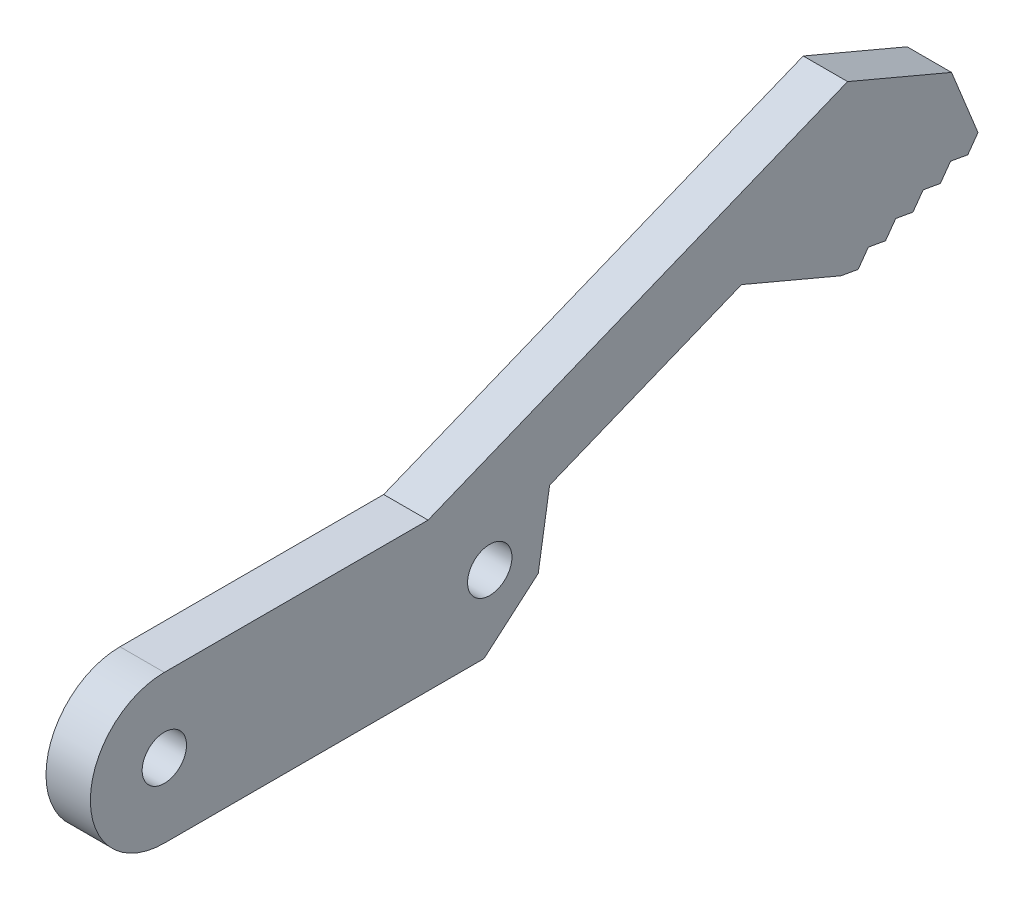
ISO-10303-21;
HEADER;
FILE_DESCRIPTION(('STEP AP214'),'2;1');
FILE_NAME('part.step','',(''),(''),'','','');
FILE_SCHEMA(('AUTOMOTIVE_DESIGN { 1 0 10303 214 1 1 1 1 }'));
ENDSEC;
DATA;
#1=APPLICATION_CONTEXT('core data for automotive mechanical design processes');
#2=APPLICATION_PROTOCOL_DEFINITION('international standard','automotive_design',2000,#1);
#3=PRODUCT_CONTEXT('',#1,'mechanical');
#4=PRODUCT('Part','Part','',(#3));
#5=PRODUCT_RELATED_PRODUCT_CATEGORY('part','',(#4));
#6=PRODUCT_DEFINITION_FORMATION('','',#4);
#7=PRODUCT_DEFINITION_CONTEXT('part definition',#1,'design');
#8=PRODUCT_DEFINITION('design','',#6,#7);
#9=PRODUCT_DEFINITION_SHAPE('','',#8);
#10=(LENGTH_UNIT() NAMED_UNIT(*) SI_UNIT(.MILLI.,.METRE.));
#11=(NAMED_UNIT(*) PLANE_ANGLE_UNIT() SI_UNIT($,.RADIAN.));
#12=(NAMED_UNIT(*) SI_UNIT($,.STERADIAN.) SOLID_ANGLE_UNIT());
#13=UNCERTAINTY_MEASURE_WITH_UNIT(LENGTH_MEASURE(1.E-05),#10,'distance_accuracy_value','');
#14=(GEOMETRIC_REPRESENTATION_CONTEXT(3) GLOBAL_UNCERTAINTY_ASSIGNED_CONTEXT((#13)) GLOBAL_UNIT_ASSIGNED_CONTEXT((#10,
#11,#12)) REPRESENTATION_CONTEXT('',''));
#15=CARTESIAN_POINT('',(0.,0.,0.));
#16=DIRECTION('',(0.,0.,1.));
#17=DIRECTION('',(1.,0.,0.));
#18=AXIS2_PLACEMENT_3D('',#15,#16,#17);
#19=CARTESIAN_POINT('',(1.5,0.,0.));
#20=DIRECTION('',(1.,0.,0.));
#21=DIRECTION('',(0.,0.,-1.));
#22=AXIS2_PLACEMENT_3D('',#19,#20,#21);
#23=PLANE('',#22);
#24=CARTESIAN_POINT('',(1.5,0.,-11.));
#25=DIRECTION('',(1.,0.,0.));
#26=DIRECTION('',(0.,0.,-1.));
#27=AXIS2_PLACEMENT_3D('',#24,#25,#26);
#28=CIRCLE('',#27,1.5);
#29=CARTESIAN_POINT('',(1.5,0.,-12.5));
#30=VERTEX_POINT('',#29);
#31=EDGE_CURVE('E117',#30,#30,#28,.T.);
#32=ORIENTED_EDGE('',*,*,#31,.F.);
#33=EDGE_LOOP('',(#32));
#34=FACE_BOUND('',#33,.T.);
#35=CARTESIAN_POINT('',(1.5,0.,11.));
#36=DIRECTION('',(1.,0.,0.));
#37=DIRECTION('',(0.,0.,-1.));
#38=AXIS2_PLACEMENT_3D('',#35,#36,#37);
#39=CIRCLE('',#38,1.5);
#40=CARTESIAN_POINT('',(1.5,0.,9.50000000000001));
#41=VERTEX_POINT('',#40);
#42=EDGE_CURVE('E88',#41,#41,#39,.T.);
#43=ORIENTED_EDGE('',*,*,#42,.F.);
#44=EDGE_LOOP('',(#43));
#45=FACE_BOUND('',#44,.T.);
#46=DIRECTION('',(0.,0.811746559900306,-0.584009865062243));
#47=VECTOR('',#46,1.);
#48=CARTESIAN_POINT('',(1.5,-17.1372740545539,-23.8200141676892));
#49=LINE('',#48,#47);
#50=CARTESIAN_POINT('',(1.5,7.39191676895877,-41.4675043211245));
#51=VERTEX_POINT('',#50);
#52=CARTESIAN_POINT('',(1.5,8.35132428291398,-42.1577486417576));
#53=VERTEX_POINT('',#52);
#54=EDGE_CURVE('E275',#51,#53,#49,.T.);
#55=ORIENTED_EDGE('',*,*,#54,.T.);
#56=DIRECTION('',(0.,-0.176310458660285,-0.984334608843456));
#57=VECTOR('',#56,1.);
#58=CARTESIAN_POINT('',(1.5,15.4081336773122,-2.7598492335221));
#59=LINE('',#58,#57);
#60=CARTESIAN_POINT('',(1.5,8.14294202768355,-43.3211388753874));
#61=VERTEX_POINT('',#60);
#62=EDGE_CURVE('E279',#53,#61,#59,.T.);
#63=ORIENTED_EDGE('',*,*,#62,.T.);
#64=DIRECTION('',(0.,0.811746559900309,-0.584009865062239));
#65=VECTOR('',#64,1.);
#66=CARTESIAN_POINT('',(1.5,-17.7598725540869,-24.6853971353918));
#67=LINE('',#66,#65);
#68=CARTESIAN_POINT('',(1.5,9.10234954163876,-44.0113831960205));
#69=VERTEX_POINT('',#68);
#70=EDGE_CURVE('E228',#61,#69,#67,.T.);
#71=ORIENTED_EDGE('',*,*,#70,.T.);
#72=DIRECTION('',(0.,0.926817277131445,0.375512629362388));
#73=VECTOR('',#72,1.);
#74=CARTESIAN_POINT('',(1.5,16.6008716845223,-40.9732549309526));
#75=LINE('',#74,#73);
#76=CARTESIAN_POINT('',(1.5,13.5184546570459,-42.2221381265287));
#77=VERTEX_POINT('',#76);
#78=EDGE_CURVE('E51',#69,#77,#75,.T.);
#79=ORIENTED_EDGE('',*,*,#78,.T.);
#80=DIRECTION('',(0.,-0.389831254937157,-0.920886308223834));
#81=VECTOR('',#80,1.);
#82=CARTESIAN_POINT('',(1.5,16.4926366310558,-35.1963201005385));
#83=LINE('',#82,#81);
#84=CARTESIAN_POINT('',(1.5,16.4926366310558,-35.1963201005385));
#85=VERTEX_POINT('',#84);
#86=EDGE_CURVE('E179',#85,#77,#83,.T.);
#87=ORIENTED_EDGE('',*,*,#86,.F.);
#88=DIRECTION('',(0.,0.375512629362387,-0.926817277131445));
#89=VECTOR('',#88,1.);
#90=CARTESIAN_POINT('',(1.5,1.91758297252369,0.776934830414033));
#91=LINE('',#90,#89);
#92=CARTESIAN_POINT('',(1.5,5.,-6.83089812380655));
#93=VERTEX_POINT('',#92);
#94=EDGE_CURVE('E162',#93,#85,#91,.T.);
#95=ORIENTED_EDGE('',*,*,#94,.F.);
#96=DIRECTION('',(0.,0.,-1.));
#97=VECTOR('',#96,1.);
#98=CARTESIAN_POINT('',(1.5,4.99999999999999,0.));
#99=LINE('',#98,#97);
#100=CARTESIAN_POINT('',(1.5,5.,11.));
#101=VERTEX_POINT('',#100);
#102=EDGE_CURVE('E103',#101,#93,#99,.T.);
#103=ORIENTED_EDGE('',*,*,#102,.F.);
#104=CARTESIAN_POINT('',(1.5,0.,11.));
#105=DIRECTION('',(1.,0.,0.));
#106=DIRECTION('',(0.,0.,-1.));
#107=AXIS2_PLACEMENT_3D('',#104,#105,#106);
#108=CIRCLE('',#107,5.);
#109=CARTESIAN_POINT('',(1.5,-5.,11.));
#110=VERTEX_POINT('',#109);
#111=EDGE_CURVE('E59',#101,#110,#108,.T.);
#112=ORIENTED_EDGE('',*,*,#111,.T.);
#113=DIRECTION('',(0.,0.,-1.));
#114=VECTOR('',#113,1.);
#115=CARTESIAN_POINT('',(1.5,-5.,0.));
#116=LINE('',#115,#114);
#117=CARTESIAN_POINT('',(1.5,-5.,-10.6103174919287));
#118=VERTEX_POINT('',#117);
#119=EDGE_CURVE('E87',#110,#118,#116,.T.);
#120=ORIENTED_EDGE('',*,*,#119,.T.);
#121=DIRECTION('',(0.,-0.652055247286905,0.758171454544164));
#122=VECTOR('',#121,1.);
#123=CARTESIAN_POINT('',(1.5,-8.11953898551642,-6.9831012092637));
#124=LINE('',#123,#122);
#125=CARTESIAN_POINT('',(1.5,-1.84405260313138,-14.2798673319224));
#126=VERTEX_POINT('',#125);
#127=EDGE_CURVE('E229',#126,#118,#124,.T.);
#128=ORIENTED_EDGE('',*,*,#127,.F.);
#129=DIRECTION('',(0.,-0.987317731643147,0.158756722008964));
#130=VECTOR('',#129,1.);
#131=CARTESIAN_POINT('',(1.5,-2.2847508524873,-14.209004825132));
#132=LINE('',#131,#130);
#133=CARTESIAN_POINT('',(1.5,2.93456521802145,-15.0482498664458));
#134=VERTEX_POINT('',#133);
#135=EDGE_CURVE('E233',#134,#126,#132,.T.);
#136=ORIENTED_EDGE('',*,*,#135,.F.);
#137=DIRECTION('',(0.,0.375512629362387,-0.926817277131445));
#138=VECTOR('',#137,1.);
#139=CARTESIAN_POINT('',(1.5,-2.71650341313353,-1.1006283163979));
#140=LINE('',#139,#138);
#141=CARTESIAN_POINT('',(1.5,8.19174202909487,-28.0236917462861));
#142=VERTEX_POINT('',#141);
#143=EDGE_CURVE('E137',#134,#142,#140,.T.);
#144=ORIENTED_EDGE('',*,*,#143,.T.);
#145=DIRECTION('',(0.,0.389831254937156,0.920886308223834));
#146=VECTOR('',#145,1.);
#147=CARTESIAN_POINT('',(1.5,17.0070885712925,-7.19947144546189));
#148=LINE('',#147,#146);
#149=CARTESIAN_POINT('',(1.5,5.34722324801488,-34.743210424706));
#150=VERTEX_POINT('',#149);
#151=EDGE_CURVE('E159',#150,#142,#148,.T.);
#152=ORIENTED_EDGE('',*,*,#151,.F.);
#153=DIRECTION('',(0.,-0.176310458660285,-0.984334608843456));
#154=VECTOR('',#153,1.);
#155=CARTESIAN_POINT('',(1.5,11.2106343735009,-2.00800832410744));
#156=LINE('',#155,#154);
#157=CARTESIAN_POINT('',(1.5,5.13884099278445,-35.9066006583358));
#158=VERTEX_POINT('',#157);
#159=EDGE_CURVE('E252',#150,#158,#156,.T.);
#160=ORIENTED_EDGE('',*,*,#159,.T.);
#161=DIRECTION('',(0.,0.811746559900309,-0.584009865062239));
#162=VECTOR('',#161,1.);
#163=CARTESIAN_POINT('',(1.5,-15.2694785559546,-21.223865264582));
#164=LINE('',#163,#162);
#165=CARTESIAN_POINT('',(1.5,6.09824850673965,-36.5968449789689));
#166=VERTEX_POINT('',#165);
#167=EDGE_CURVE('E213',#158,#166,#164,.T.);
#168=ORIENTED_EDGE('',*,*,#167,.T.);
#169=DIRECTION('',(0.,-0.176310458660285,-0.984334608843456));
#170=VECTOR('',#169,1.);
#171=CARTESIAN_POINT('',(1.5,12.2600091994537,-2.1959685514611));
#172=LINE('',#171,#170);
#173=CARTESIAN_POINT('',(1.5,5.88986625150922,-37.7602352125987));
#174=VERTEX_POINT('',#173);
#175=EDGE_CURVE('E191',#166,#174,#172,.T.);
#176=ORIENTED_EDGE('',*,*,#175,.T.);
#177=DIRECTION('',(0.,0.811746559900306,-0.584009865062243));
#178=VECTOR('',#177,1.);
#179=CARTESIAN_POINT('',(1.5,-15.8920770554877,-22.0892482322843));
#180=LINE('',#179,#178);
#181=CARTESIAN_POINT('',(1.5,6.84927376546443,-38.4504795332318));
#182=VERTEX_POINT('',#181);
#183=EDGE_CURVE('E253',#174,#182,#180,.T.);
#184=ORIENTED_EDGE('',*,*,#183,.T.);
#185=DIRECTION('',(0.,-0.176310458660286,-0.984334608843456));
#186=VECTOR('',#185,1.);
#187=CARTESIAN_POINT('',(1.5,13.3093840254066,-2.38392877881479));
#188=LINE('',#187,#186);
#189=CARTESIAN_POINT('',(1.5,6.640891510234,-39.6138697668616));
#190=VERTEX_POINT('',#189);
#191=EDGE_CURVE('E257',#182,#190,#188,.T.);
#192=ORIENTED_EDGE('',*,*,#191,.T.);
#193=DIRECTION('',(0.,0.811746559900306,-0.584009865062243));
#194=VECTOR('',#193,1.);
#195=CARTESIAN_POINT('',(1.5,-16.5146755550208,-22.9546311999867));
#196=LINE('',#195,#194);
#197=CARTESIAN_POINT('',(1.5,7.6002990241892,-40.3041140874947));
#198=VERTEX_POINT('',#197);
#199=EDGE_CURVE('E192',#190,#198,#196,.T.);
#200=ORIENTED_EDGE('',*,*,#199,.T.);
#201=DIRECTION('',(0.,-0.176310458660286,-0.984334608843456));
#202=VECTOR('',#201,1.);
#203=CARTESIAN_POINT('',(1.5,14.3587588513594,-2.57188900616846));
#204=LINE('',#203,#202);
#205=EDGE_CURVE('E196',#198,#51,#204,.T.);
#206=ORIENTED_EDGE('',*,*,#205,.T.);
#207=EDGE_LOOP('',(#55,#63,#71,#79,#87,#95,#103,#112,#120,#128,#136,#144,#152,#160,#168,#176,
#184,#192,#200,#206));
#208=FACE_BOUND('',#207,.T.);
#209=ADVANCED_FACE('F36',(#34,#45,#208),#23,.T.);
#210=CARTESIAN_POINT('',(-1.5,0.,0.));
#211=DIRECTION('',(1.,0.,0.));
#212=DIRECTION('',(0.,0.,-1.));
#213=AXIS2_PLACEMENT_3D('',#210,#211,#212);
#214=PLANE('',#213);
#215=CARTESIAN_POINT('',(-1.5,0.,-11.));
#216=DIRECTION('',(1.,0.,0.));
#217=DIRECTION('',(0.,0.,-1.));
#218=AXIS2_PLACEMENT_3D('',#215,#216,#217);
#219=CIRCLE('',#218,1.5);
#220=CARTESIAN_POINT('',(-1.5,0.,-12.5));
#221=VERTEX_POINT('',#220);
#222=EDGE_CURVE('E95',#221,#221,#219,.T.);
#223=ORIENTED_EDGE('',*,*,#222,.T.);
#224=EDGE_LOOP('',(#223));
#225=FACE_BOUND('',#224,.T.);
#226=CARTESIAN_POINT('',(-1.5,0.,11.));
#227=DIRECTION('',(1.,0.,0.));
#228=DIRECTION('',(0.,0.,-1.));
#229=AXIS2_PLACEMENT_3D('',#226,#227,#228);
#230=CIRCLE('',#229,1.5);
#231=CARTESIAN_POINT('',(-1.5,0.,9.50000000000001));
#232=VERTEX_POINT('',#231);
#233=EDGE_CURVE('E98',#232,#232,#230,.T.);
#234=ORIENTED_EDGE('',*,*,#233,.T.);
#235=EDGE_LOOP('',(#234));
#236=FACE_BOUND('',#235,.T.);
#237=DIRECTION('',(0.,-0.176310458660285,-0.984334608843456));
#238=VECTOR('',#237,1.);
#239=CARTESIAN_POINT('',(-1.5,15.4081336773122,-2.7598492335221));
#240=LINE('',#239,#238);
#241=CARTESIAN_POINT('',(-1.5,8.35132428291398,-42.1577486417576));
#242=VERTEX_POINT('',#241);
#243=CARTESIAN_POINT('',(-1.5,8.14294202768355,-43.3211388753874));
#244=VERTEX_POINT('',#243);
#245=EDGE_CURVE('E278',#242,#244,#240,.T.);
#246=ORIENTED_EDGE('',*,*,#245,.F.);
#247=DIRECTION('',(0.,0.811746559900306,-0.584009865062243));
#248=VECTOR('',#247,1.);
#249=CARTESIAN_POINT('',(-1.5,-17.1372740545539,-23.8200141676892));
#250=LINE('',#249,#248);
#251=CARTESIAN_POINT('',(-1.5,7.39191676895877,-41.4675043211245));
#252=VERTEX_POINT('',#251);
#253=EDGE_CURVE('E272',#252,#242,#250,.T.);
#254=ORIENTED_EDGE('',*,*,#253,.F.);
#255=DIRECTION('',(0.,-0.176310458660286,-0.984334608843456));
#256=VECTOR('',#255,1.);
#257=CARTESIAN_POINT('',(-1.5,14.3587588513594,-2.57188900616846));
#258=LINE('',#257,#256);
#259=CARTESIAN_POINT('',(-1.5,7.6002990241892,-40.3041140874947));
#260=VERTEX_POINT('',#259);
#261=EDGE_CURVE('E195',#260,#252,#258,.T.);
#262=ORIENTED_EDGE('',*,*,#261,.F.);
#263=DIRECTION('',(0.,0.811746559900306,-0.584009865062243));
#264=VECTOR('',#263,1.);
#265=CARTESIAN_POINT('',(-1.5,-16.5146755550208,-22.9546311999867));
#266=LINE('',#265,#264);
#267=CARTESIAN_POINT('',(-1.5,6.640891510234,-39.6138697668616));
#268=VERTEX_POINT('',#267);
#269=EDGE_CURVE('E188',#268,#260,#266,.T.);
#270=ORIENTED_EDGE('',*,*,#269,.F.);
#271=DIRECTION('',(0.,-0.176310458660286,-0.984334608843456));
#272=VECTOR('',#271,1.);
#273=CARTESIAN_POINT('',(-1.5,13.3093840254066,-2.38392877881479));
#274=LINE('',#273,#272);
#275=CARTESIAN_POINT('',(-1.5,6.84927376546443,-38.4504795332318));
#276=VERTEX_POINT('',#275);
#277=EDGE_CURVE('E256',#276,#268,#274,.T.);
#278=ORIENTED_EDGE('',*,*,#277,.F.);
#279=DIRECTION('',(0.,0.811746559900306,-0.584009865062243));
#280=VECTOR('',#279,1.);
#281=CARTESIAN_POINT('',(-1.5,-15.8920770554877,-22.0892482322843));
#282=LINE('',#281,#280);
#283=CARTESIAN_POINT('',(-1.5,5.88986625150922,-37.7602352125987));
#284=VERTEX_POINT('',#283);
#285=EDGE_CURVE('E249',#284,#276,#282,.T.);
#286=ORIENTED_EDGE('',*,*,#285,.F.);
#287=DIRECTION('',(0.,-0.176310458660285,-0.984334608843456));
#288=VECTOR('',#287,1.);
#289=CARTESIAN_POINT('',(-1.5,12.2600091994537,-2.1959685514611));
#290=LINE('',#289,#288);
#291=CARTESIAN_POINT('',(-1.5,6.09824850673965,-36.5968449789689));
#292=VERTEX_POINT('',#291);
#293=EDGE_CURVE('E216',#292,#284,#290,.T.);
#294=ORIENTED_EDGE('',*,*,#293,.F.);
#295=DIRECTION('',(0.,0.811746559900309,-0.584009865062239));
#296=VECTOR('',#295,1.);
#297=CARTESIAN_POINT('',(-1.5,-15.2694785559546,-21.223865264582));
#298=LINE('',#297,#296);
#299=CARTESIAN_POINT('',(-1.5,5.13884099278445,-35.9066006583358));
#300=VERTEX_POINT('',#299);
#301=EDGE_CURVE('E208',#300,#292,#298,.T.);
#302=ORIENTED_EDGE('',*,*,#301,.F.);
#303=DIRECTION('',(0.,-0.176310458660285,-0.984334608843456));
#304=VECTOR('',#303,1.);
#305=CARTESIAN_POINT('',(-1.5,11.2106343735009,-2.00800832410744));
#306=LINE('',#305,#304);
#307=CARTESIAN_POINT('',(-1.5,5.34722324801488,-34.743210424706));
#308=VERTEX_POINT('',#307);
#309=EDGE_CURVE('E236',#308,#300,#306,.T.);
#310=ORIENTED_EDGE('',*,*,#309,.F.);
#311=DIRECTION('',(0.,0.389831254937156,0.920886308223834));
#312=VECTOR('',#311,1.);
#313=CARTESIAN_POINT('',(-1.5,17.0070885712925,-7.19947144546189));
#314=LINE('',#313,#312);
#315=CARTESIAN_POINT('',(-1.5,8.19174202909487,-28.0236917462861));
#316=VERTEX_POINT('',#315);
#317=EDGE_CURVE('E166',#308,#316,#314,.T.);
#318=ORIENTED_EDGE('',*,*,#317,.T.);
#319=DIRECTION('',(0.,0.375512629362387,-0.926817277131445));
#320=VECTOR('',#319,1.);
#321=CARTESIAN_POINT('',(-1.5,-2.71650341313353,-1.1006283163979));
#322=LINE('',#321,#320);
#323=CARTESIAN_POINT('',(-1.5,2.93456521802145,-15.0482498664458));
#324=VERTEX_POINT('',#323);
#325=EDGE_CURVE('E145',#324,#316,#322,.T.);
#326=ORIENTED_EDGE('',*,*,#325,.F.);
#327=DIRECTION('',(0.,-0.987317731643147,0.158756722008964));
#328=VECTOR('',#327,1.);
#329=CARTESIAN_POINT('',(-1.5,-2.2847508524873,-14.209004825132));
#330=LINE('',#329,#328);
#331=CARTESIAN_POINT('',(-1.5,-1.84405260313138,-14.2798673319224));
#332=VERTEX_POINT('',#331);
#333=EDGE_CURVE('E232',#324,#332,#330,.T.);
#334=ORIENTED_EDGE('',*,*,#333,.T.);
#335=DIRECTION('',(0.,-0.652055247286905,0.758171454544164));
#336=VECTOR('',#335,1.);
#337=CARTESIAN_POINT('',(-1.5,-8.11953898551642,-6.9831012092637));
#338=LINE('',#337,#336);
#339=CARTESIAN_POINT('',(-1.5,-5.,-10.6103174919287));
#340=VERTEX_POINT('',#339);
#341=EDGE_CURVE('E94',#332,#340,#338,.T.);
#342=ORIENTED_EDGE('',*,*,#341,.T.);
#343=DIRECTION('',(0.,0.,-1.));
#344=VECTOR('',#343,1.);
#345=CARTESIAN_POINT('',(-1.5,-5.,0.));
#346=LINE('',#345,#344);
#347=CARTESIAN_POINT('',(-1.5,-5.,11.));
#348=VERTEX_POINT('',#347);
#349=EDGE_CURVE('E79',#348,#340,#346,.T.);
#350=ORIENTED_EDGE('',*,*,#349,.F.);
#351=CARTESIAN_POINT('',(-1.5,0.,11.));
#352=DIRECTION('',(1.,0.,0.));
#353=DIRECTION('',(0.,0.,-1.));
#354=AXIS2_PLACEMENT_3D('',#351,#352,#353);
#355=CIRCLE('',#354,5.);
#356=CARTESIAN_POINT('',(-1.5,5.,11.));
#357=VERTEX_POINT('',#356);
#358=EDGE_CURVE('E71',#357,#348,#355,.T.);
#359=ORIENTED_EDGE('',*,*,#358,.F.);
#360=DIRECTION('',(0.,0.,-1.));
#361=VECTOR('',#360,1.);
#362=CARTESIAN_POINT('',(-1.5,4.99999999999999,0.));
#363=LINE('',#362,#361);
#364=CARTESIAN_POINT('',(-1.5,5.,-6.83089812380655));
#365=VERTEX_POINT('',#364);
#366=EDGE_CURVE('E80',#357,#365,#363,.T.);
#367=ORIENTED_EDGE('',*,*,#366,.T.);
#368=DIRECTION('',(0.,0.375512629362387,-0.926817277131445));
#369=VECTOR('',#368,1.);
#370=CARTESIAN_POINT('',(-1.5,1.91758297252369,0.776934830414033));
#371=LINE('',#370,#369);
#372=CARTESIAN_POINT('',(-1.5,16.4926366310558,-35.1963201005385));
#373=VERTEX_POINT('',#372);
#374=EDGE_CURVE('E151',#365,#373,#371,.T.);
#375=ORIENTED_EDGE('',*,*,#374,.T.);
#376=DIRECTION('',(0.,-0.389831254937157,-0.920886308223834));
#377=VECTOR('',#376,1.);
#378=CARTESIAN_POINT('',(-1.5,16.4926366310558,-35.1963201005385));
#379=LINE('',#378,#377);
#380=CARTESIAN_POINT('',(-1.5,13.5184546570459,-42.2221381265287));
#381=VERTEX_POINT('',#380);
#382=EDGE_CURVE('E176',#373,#381,#379,.T.);
#383=ORIENTED_EDGE('',*,*,#382,.T.);
#384=DIRECTION('',(0.,0.926817277131445,0.375512629362388));
#385=VECTOR('',#384,1.);
#386=CARTESIAN_POINT('',(-1.5,16.6008716845223,-40.9732549309526));
#387=LINE('',#386,#385);
#388=CARTESIAN_POINT('',(-1.5,9.10234954163876,-44.0113831960205));
#389=VERTEX_POINT('',#388);
#390=EDGE_CURVE('E155',#389,#381,#387,.T.);
#391=ORIENTED_EDGE('',*,*,#390,.F.);
#392=DIRECTION('',(0.,0.811746559900309,-0.584009865062239));
#393=VECTOR('',#392,1.);
#394=CARTESIAN_POINT('',(-1.5,-17.7598725540869,-24.6853971353918));
#395=LINE('',#394,#393);
#396=EDGE_CURVE('E241',#244,#389,#395,.T.);
#397=ORIENTED_EDGE('',*,*,#396,.F.);
#398=EDGE_LOOP('',(#246,#254,#262,#270,#278,#286,#294,#302,#310,#318,#326,#334,#342,#350,#359,
#367,#375,#383,#391,#397));
#399=FACE_BOUND('',#398,.T.);
#400=ADVANCED_FACE('F91',(#225,#236,#399),#214,.F.);
#401=CARTESIAN_POINT('',(-1.5,16.6008716845223,-40.9732549309526));
#402=DIRECTION('',(0.,0.375512629362387,-0.926817277131445));
#403=DIRECTION('',(0.,0.926817277131445,0.375512629362388));
#404=AXIS2_PLACEMENT_3D('',#401,#402,#403);
#405=PLANE('',#404);
#406=ORIENTED_EDGE('',*,*,#78,.F.);
#407=DIRECTION('',(1.,0.,0.));
#408=VECTOR('',#407,1.);
#409=CARTESIAN_POINT('',(-1.5,9.10234954163876,-44.0113831960205));
#410=LINE('',#409,#408);
#411=EDGE_CURVE('E199',#389,#69,#410,.T.);
#412=ORIENTED_EDGE('',*,*,#411,.F.);
#413=ORIENTED_EDGE('',*,*,#390,.T.);
#414=DIRECTION('',(1.,0.,0.));
#415=VECTOR('',#414,1.);
#416=CARTESIAN_POINT('',(-1.5,13.5184546570459,-42.2221381265287));
#417=LINE('',#416,#415);
#418=EDGE_CURVE('E161',#381,#77,#417,.T.);
#419=ORIENTED_EDGE('',*,*,#418,.T.);
#420=EDGE_LOOP('',(#406,#412,#413,#419));
#421=FACE_BOUND('',#420,.T.);
#422=ADVANCED_FACE('F309',(#421),#405,.T.);
#423=CARTESIAN_POINT('',(1.5,4.99999999999999,0.));
#424=DIRECTION('',(0.,1.,0.));
#425=DIRECTION('',(0.,0.,1.));
#426=AXIS2_PLACEMENT_3D('',#423,#424,#425);
#427=PLANE('',#426);
#428=ORIENTED_EDGE('',*,*,#102,.T.);
#429=DIRECTION('',(1.,0.,0.));
#430=VECTOR('',#429,1.);
#431=CARTESIAN_POINT('',(-1.5,5.,-6.83089812380655));
#432=LINE('',#431,#430);
#433=EDGE_CURVE('E134',#365,#93,#432,.T.);
#434=ORIENTED_EDGE('',*,*,#433,.F.);
#435=ORIENTED_EDGE('',*,*,#366,.F.);
#436=DIRECTION('',(-1.,0.,0.));
#437=VECTOR('',#436,1.);
#438=CARTESIAN_POINT('',(1.5,5.,11.));
#439=LINE('',#438,#437);
#440=EDGE_CURVE('E12',#101,#357,#439,.T.);
#441=ORIENTED_EDGE('',*,*,#440,.F.);
#442=EDGE_LOOP('',(#428,#434,#435,#441));
#443=FACE_BOUND('',#442,.T.);
#444=ADVANCED_FACE('F38',(#443),#427,.T.);
#445=CARTESIAN_POINT('',(1.5,0.,11.));
#446=DIRECTION('',(-1.,0.,0.));
#447=DIRECTION('',(0.,0.,1.));
#448=AXIS2_PLACEMENT_3D('',#445,#446,#447);
#449=CYLINDRICAL_SURFACE('',#448,5.);
#450=ORIENTED_EDGE('',*,*,#358,.T.);
#451=DIRECTION('',(-1.,0.,0.));
#452=VECTOR('',#451,1.);
#453=CARTESIAN_POINT('',(1.5,-5.,11.));
#454=LINE('',#453,#452);
#455=EDGE_CURVE('E44',#110,#348,#454,.T.);
#456=ORIENTED_EDGE('',*,*,#455,.F.);
#457=ORIENTED_EDGE('',*,*,#111,.F.);
#458=ORIENTED_EDGE('',*,*,#440,.T.);
#459=EDGE_LOOP('',(#450,#456,#457,#458));
#460=FACE_BOUND('',#459,.T.);
#461=ADVANCED_FACE('F73',(#460),#449,.T.);
#462=CARTESIAN_POINT('',(1.5,-5.,0.));
#463=DIRECTION('',(0.,1.,0.));
#464=DIRECTION('',(0.,0.,1.));
#465=AXIS2_PLACEMENT_3D('',#462,#463,#464);
#466=PLANE('',#465);
#467=ORIENTED_EDGE('',*,*,#349,.T.);
#468=DIRECTION('',(1.,0.,0.));
#469=VECTOR('',#468,1.);
#470=CARTESIAN_POINT('',(-1.5,-5.,-10.6103174919287));
#471=LINE('',#470,#469);
#472=EDGE_CURVE('E226',#340,#118,#471,.T.);
#473=ORIENTED_EDGE('',*,*,#472,.T.);
#474=ORIENTED_EDGE('',*,*,#119,.F.);
#475=ORIENTED_EDGE('',*,*,#455,.T.);
#476=EDGE_LOOP('',(#467,#473,#474,#475));
#477=FACE_BOUND('',#476,.T.);
#478=ADVANCED_FACE('F84',(#477),#466,.F.);
#479=CARTESIAN_POINT('',(1.5,0.,-11.));
#480=DIRECTION('',(-1.,0.,0.));
#481=DIRECTION('',(0.,0.,1.));
#482=AXIS2_PLACEMENT_3D('',#479,#480,#481);
#483=CYLINDRICAL_SURFACE('',#482,1.5);
#484=ORIENTED_EDGE('',*,*,#31,.T.);
#485=EDGE_LOOP('',(#484));
#486=FACE_BOUND('',#485,.T.);
#487=ORIENTED_EDGE('',*,*,#222,.F.);
#488=EDGE_LOOP('',(#487));
#489=FACE_BOUND('',#488,.T.);
#490=ADVANCED_FACE('F429',(#486,#489),#483,.F.);
#491=CARTESIAN_POINT('',(1.5,0.,11.));
#492=DIRECTION('',(-1.,0.,0.));
#493=DIRECTION('',(0.,0.,1.));
#494=AXIS2_PLACEMENT_3D('',#491,#492,#493);
#495=CYLINDRICAL_SURFACE('',#494,1.5);
#496=ORIENTED_EDGE('',*,*,#42,.T.);
#497=EDGE_LOOP('',(#496));
#498=FACE_BOUND('',#497,.T.);
#499=ORIENTED_EDGE('',*,*,#233,.F.);
#500=EDGE_LOOP('',(#499));
#501=FACE_BOUND('',#500,.T.);
#502=ADVANCED_FACE('F426',(#498,#501),#495,.F.);
#503=CARTESIAN_POINT('',(-1.5,17.0070885712925,-7.19947144546189));
#504=DIRECTION('',(0.,0.920886308223834,-0.389831254937156));
#505=DIRECTION('',(0.,0.389831254937156,0.920886308223834));
#506=AXIS2_PLACEMENT_3D('',#503,#504,#505);
#507=PLANE('',#506);
#508=ORIENTED_EDGE('',*,*,#151,.T.);
#509=DIRECTION('',(1.,0.,0.));
#510=VECTOR('',#509,1.);
#511=CARTESIAN_POINT('',(-1.5,8.19174202909487,-28.0236917462861));
#512=LINE('',#511,#510);
#513=EDGE_CURVE('E121',#316,#142,#512,.T.);
#514=ORIENTED_EDGE('',*,*,#513,.F.);
#515=ORIENTED_EDGE('',*,*,#317,.F.);
#516=DIRECTION('',(1.,0.,0.));
#517=VECTOR('',#516,1.);
#518=CARTESIAN_POINT('',(-1.5,5.34722324801488,-34.743210424706));
#519=LINE('',#518,#517);
#520=EDGE_CURVE('E113',#308,#150,#519,.T.);
#521=ORIENTED_EDGE('',*,*,#520,.T.);
#522=EDGE_LOOP('',(#508,#514,#515,#521));
#523=FACE_BOUND('',#522,.T.);
#524=ADVANCED_FACE('F402',(#523),#507,.F.);
#525=CARTESIAN_POINT('',(-1.5,-2.71650341313353,-1.1006283163979));
#526=DIRECTION('',(0.,-0.926817277131445,-0.375512629362387));
#527=DIRECTION('',(0.,0.375512629362387,-0.926817277131445));
#528=AXIS2_PLACEMENT_3D('',#525,#526,#527);
#529=PLANE('',#528);
#530=ORIENTED_EDGE('',*,*,#143,.F.);
#531=DIRECTION('',(1.,0.,0.));
#532=VECTOR('',#531,1.);
#533=CARTESIAN_POINT('',(-1.5,2.93456521802145,-15.0482498664458));
#534=LINE('',#533,#532);
#535=EDGE_CURVE('E125',#324,#134,#534,.T.);
#536=ORIENTED_EDGE('',*,*,#535,.F.);
#537=ORIENTED_EDGE('',*,*,#325,.T.);
#538=ORIENTED_EDGE('',*,*,#513,.T.);
#539=EDGE_LOOP('',(#530,#536,#537,#538));
#540=FACE_BOUND('',#539,.T.);
#541=ADVANCED_FACE('F330',(#540),#529,.T.);
#542=CARTESIAN_POINT('',(-1.5,1.91758297252369,0.776934830414033));
#543=DIRECTION('',(0.,-0.926817277131445,-0.375512629362387));
#544=DIRECTION('',(0.,0.375512629362387,-0.926817277131445));
#545=AXIS2_PLACEMENT_3D('',#542,#543,#544);
#546=PLANE('',#545);
#547=ORIENTED_EDGE('',*,*,#94,.T.);
#548=DIRECTION('',(1.,0.,0.));
#549=VECTOR('',#548,1.);
#550=CARTESIAN_POINT('',(-1.5,16.4926366310558,-35.1963201005385));
#551=LINE('',#550,#549);
#552=EDGE_CURVE('E173',#373,#85,#551,.T.);
#553=ORIENTED_EDGE('',*,*,#552,.F.);
#554=ORIENTED_EDGE('',*,*,#374,.F.);
#555=ORIENTED_EDGE('',*,*,#433,.T.);
#556=EDGE_LOOP('',(#547,#553,#554,#555));
#557=FACE_BOUND('',#556,.T.);
#558=ADVANCED_FACE('F445',(#557),#546,.F.);
#559=CARTESIAN_POINT('',(-1.5,16.4926366310558,-35.1963201005385));
#560=DIRECTION('',(0.,-0.920886308223833,0.389831254937157));
#561=DIRECTION('',(0.,-0.389831254937157,-0.920886308223834));
#562=AXIS2_PLACEMENT_3D('',#559,#560,#561);
#563=PLANE('',#562);
#564=ORIENTED_EDGE('',*,*,#86,.T.);
#565=ORIENTED_EDGE('',*,*,#418,.F.);
#566=ORIENTED_EDGE('',*,*,#382,.F.);
#567=ORIENTED_EDGE('',*,*,#552,.T.);
#568=EDGE_LOOP('',(#564,#565,#566,#567));
#569=FACE_BOUND('',#568,.T.);
#570=ADVANCED_FACE('F313',(#569),#563,.F.);
#571=CARTESIAN_POINT('',(-1.5,12.2600091994537,-2.1959685514611));
#572=DIRECTION('',(0.,-0.984334608843456,0.176310458660285));
#573=DIRECTION('',(0.,-0.176310458660285,-0.984334608843456));
#574=AXIS2_PLACEMENT_3D('',#571,#572,#573);
#575=PLANE('',#574);
#576=ORIENTED_EDGE('',*,*,#175,.F.);
#577=DIRECTION('',(1.,0.,0.));
#578=VECTOR('',#577,1.);
#579=CARTESIAN_POINT('',(-1.5,6.09824850673965,-36.5968449789689));
#580=LINE('',#579,#578);
#581=EDGE_CURVE('E204',#292,#166,#580,.T.);
#582=ORIENTED_EDGE('',*,*,#581,.F.);
#583=ORIENTED_EDGE('',*,*,#293,.T.);
#584=DIRECTION('',(1.,0.,0.));
#585=VECTOR('',#584,1.);
#586=CARTESIAN_POINT('',(-1.5,5.88986625150922,-37.7602352125987));
#587=LINE('',#586,#585);
#588=EDGE_CURVE('E181',#284,#174,#587,.T.);
#589=ORIENTED_EDGE('',*,*,#588,.T.);
#590=EDGE_LOOP('',(#576,#582,#583,#589));
#591=FACE_BOUND('',#590,.T.);
#592=ADVANCED_FACE('F397',(#591),#575,.T.);
#593=CARTESIAN_POINT('',(-1.5,-15.2694785559546,-21.223865264582));
#594=DIRECTION('',(0.,-0.584009865062239,-0.811746559900309));
#595=DIRECTION('',(0.,0.811746559900309,-0.584009865062239));
#596=AXIS2_PLACEMENT_3D('',#593,#594,#595);
#597=PLANE('',#596);
#598=ORIENTED_EDGE('',*,*,#167,.F.);
#599=DIRECTION('',(1.,0.,0.));
#600=VECTOR('',#599,1.);
#601=CARTESIAN_POINT('',(-1.5,5.13884099278445,-35.9066006583358));
#602=LINE('',#601,#600);
#603=EDGE_CURVE('E207',#300,#158,#602,.T.);
#604=ORIENTED_EDGE('',*,*,#603,.F.);
#605=ORIENTED_EDGE('',*,*,#301,.T.);
#606=ORIENTED_EDGE('',*,*,#581,.T.);
#607=EDGE_LOOP('',(#598,#604,#605,#606));
#608=FACE_BOUND('',#607,.T.);
#609=ADVANCED_FACE('F400',(#608),#597,.T.);
#610=CARTESIAN_POINT('',(-1.5,14.3587588513594,-2.57188900616846));
#611=DIRECTION('',(0.,-0.984334608843456,0.176310458660286));
#612=DIRECTION('',(0.,-0.176310458660286,-0.984334608843456));
#613=AXIS2_PLACEMENT_3D('',#610,#611,#612);
#614=PLANE('',#613);
#615=ORIENTED_EDGE('',*,*,#205,.F.);
#616=DIRECTION('',(1.,0.,0.));
#617=VECTOR('',#616,1.);
#618=CARTESIAN_POINT('',(-1.5,7.6002990241892,-40.3041140874947));
#619=LINE('',#618,#617);
#620=EDGE_CURVE('E184',#260,#198,#619,.T.);
#621=ORIENTED_EDGE('',*,*,#620,.F.);
#622=ORIENTED_EDGE('',*,*,#261,.T.);
#623=DIRECTION('',(1.,0.,0.));
#624=VECTOR('',#623,1.);
#625=CARTESIAN_POINT('',(-1.5,7.39191676895877,-41.4675043211245));
#626=LINE('',#625,#624);
#627=EDGE_CURVE('E187',#252,#51,#626,.T.);
#628=ORIENTED_EDGE('',*,*,#627,.T.);
#629=EDGE_LOOP('',(#615,#621,#622,#628));
#630=FACE_BOUND('',#629,.T.);
#631=ADVANCED_FACE('F355',(#630),#614,.T.);
#632=CARTESIAN_POINT('',(-1.5,-16.5146755550208,-22.9546311999867));
#633=DIRECTION('',(0.,-0.584009865062243,-0.811746559900306));
#634=DIRECTION('',(0.,0.811746559900306,-0.584009865062243));
#635=AXIS2_PLACEMENT_3D('',#632,#633,#634);
#636=PLANE('',#635);
#637=ORIENTED_EDGE('',*,*,#199,.F.);
#638=DIRECTION('',(1.,0.,0.));
#639=VECTOR('',#638,1.);
#640=CARTESIAN_POINT('',(-1.5,6.640891510234,-39.6138697668616));
#641=LINE('',#640,#639);
#642=EDGE_CURVE('E248',#268,#190,#641,.T.);
#643=ORIENTED_EDGE('',*,*,#642,.F.);
#644=ORIENTED_EDGE('',*,*,#269,.T.);
#645=ORIENTED_EDGE('',*,*,#620,.T.);
#646=EDGE_LOOP('',(#637,#643,#644,#645));
#647=FACE_BOUND('',#646,.T.);
#648=ADVANCED_FACE('F349',(#647),#636,.T.);
#649=CARTESIAN_POINT('',(-1.5,-17.7598725540869,-24.6853971353918));
#650=DIRECTION('',(0.,-0.584009865062239,-0.811746559900309));
#651=DIRECTION('',(0.,0.811746559900309,-0.584009865062239));
#652=AXIS2_PLACEMENT_3D('',#649,#650,#651);
#653=PLANE('',#652);
#654=ORIENTED_EDGE('',*,*,#70,.F.);
#655=DIRECTION('',(1.,0.,0.));
#656=VECTOR('',#655,1.);
#657=CARTESIAN_POINT('',(-1.5,8.14294202768355,-43.3211388753874));
#658=LINE('',#657,#656);
#659=EDGE_CURVE('E260',#244,#61,#658,.T.);
#660=ORIENTED_EDGE('',*,*,#659,.F.);
#661=ORIENTED_EDGE('',*,*,#396,.T.);
#662=ORIENTED_EDGE('',*,*,#411,.T.);
#663=EDGE_LOOP('',(#654,#660,#661,#662));
#664=FACE_BOUND('',#663,.T.);
#665=ADVANCED_FACE('F300',(#664),#653,.T.);
#666=CARTESIAN_POINT('',(-1.5,-2.2847508524873,-14.209004825132));
#667=DIRECTION('',(0.,0.158756722008964,0.987317731643147));
#668=DIRECTION('',(0.,-0.987317731643147,0.158756722008964));
#669=AXIS2_PLACEMENT_3D('',#666,#667,#668);
#670=PLANE('',#669);
#671=ORIENTED_EDGE('',*,*,#135,.T.);
#672=DIRECTION('',(1.,0.,0.));
#673=VECTOR('',#672,1.);
#674=CARTESIAN_POINT('',(-1.5,-1.84405260313138,-14.2798673319224));
#675=LINE('',#674,#673);
#676=EDGE_CURVE('E223',#332,#126,#675,.T.);
#677=ORIENTED_EDGE('',*,*,#676,.F.);
#678=ORIENTED_EDGE('',*,*,#333,.F.);
#679=ORIENTED_EDGE('',*,*,#535,.T.);
#680=EDGE_LOOP('',(#671,#677,#678,#679));
#681=FACE_BOUND('',#680,.T.);
#682=ADVANCED_FACE('F327',(#681),#670,.F.);
#683=CARTESIAN_POINT('',(-1.5,-8.11953898551642,-6.9831012092637));
#684=DIRECTION('',(0.,0.758171454544164,0.652055247286905));
#685=DIRECTION('',(0.,-0.652055247286905,0.758171454544164));
#686=AXIS2_PLACEMENT_3D('',#683,#684,#685);
#687=PLANE('',#686);
#688=ORIENTED_EDGE('',*,*,#127,.T.);
#689=ORIENTED_EDGE('',*,*,#472,.F.);
#690=ORIENTED_EDGE('',*,*,#341,.F.);
#691=ORIENTED_EDGE('',*,*,#676,.T.);
#692=EDGE_LOOP('',(#688,#689,#690,#691));
#693=FACE_BOUND('',#692,.T.);
#694=ADVANCED_FACE('F462',(#693),#687,.F.);
#695=CARTESIAN_POINT('',(-1.5,13.3093840254066,-2.38392877881479));
#696=DIRECTION('',(0.,-0.984334608843456,0.176310458660286));
#697=DIRECTION('',(0.,-0.176310458660286,-0.984334608843456));
#698=AXIS2_PLACEMENT_3D('',#695,#696,#697);
#699=PLANE('',#698);
#700=ORIENTED_EDGE('',*,*,#191,.F.);
#701=DIRECTION('',(1.,0.,0.));
#702=VECTOR('',#701,1.);
#703=CARTESIAN_POINT('',(-1.5,6.84927376546443,-38.4504795332318));
#704=LINE('',#703,#702);
#705=EDGE_CURVE('E245',#276,#182,#704,.T.);
#706=ORIENTED_EDGE('',*,*,#705,.F.);
#707=ORIENTED_EDGE('',*,*,#277,.T.);
#708=ORIENTED_EDGE('',*,*,#642,.T.);
#709=EDGE_LOOP('',(#700,#706,#707,#708));
#710=FACE_BOUND('',#709,.T.);
#711=ADVANCED_FACE('F366',(#710),#699,.T.);
#712=CARTESIAN_POINT('',(-1.5,-15.8920770554877,-22.0892482322843));
#713=DIRECTION('',(0.,-0.584009865062243,-0.811746559900306));
#714=DIRECTION('',(0.,0.811746559900306,-0.584009865062243));
#715=AXIS2_PLACEMENT_3D('',#712,#713,#714);
#716=PLANE('',#715);
#717=ORIENTED_EDGE('',*,*,#183,.F.);
#718=ORIENTED_EDGE('',*,*,#588,.F.);
#719=ORIENTED_EDGE('',*,*,#285,.T.);
#720=ORIENTED_EDGE('',*,*,#705,.T.);
#721=EDGE_LOOP('',(#717,#718,#719,#720));
#722=FACE_BOUND('',#721,.T.);
#723=ADVANCED_FACE('F391',(#722),#716,.T.);
#724=CARTESIAN_POINT('',(-1.5,11.2106343735009,-2.00800832410744));
#725=DIRECTION('',(0.,-0.984334608843456,0.176310458660285));
#726=DIRECTION('',(0.,-0.176310458660285,-0.984334608843456));
#727=AXIS2_PLACEMENT_3D('',#724,#725,#726);
#728=PLANE('',#727);
#729=ORIENTED_EDGE('',*,*,#159,.F.);
#730=ORIENTED_EDGE('',*,*,#520,.F.);
#731=ORIENTED_EDGE('',*,*,#309,.T.);
#732=ORIENTED_EDGE('',*,*,#603,.T.);
#733=EDGE_LOOP('',(#729,#730,#731,#732));
#734=FACE_BOUND('',#733,.T.);
#735=ADVANCED_FACE('F403',(#734),#728,.T.);
#736=CARTESIAN_POINT('',(-1.5,15.4081336773122,-2.7598492335221));
#737=DIRECTION('',(0.,-0.984334608843456,0.176310458660285));
#738=DIRECTION('',(0.,-0.176310458660285,-0.984334608843456));
#739=AXIS2_PLACEMENT_3D('',#736,#737,#738);
#740=PLANE('',#739);
#741=ORIENTED_EDGE('',*,*,#62,.F.);
#742=DIRECTION('',(1.,0.,0.));
#743=VECTOR('',#742,1.);
#744=CARTESIAN_POINT('',(-1.5,8.35132428291398,-42.1577486417576));
#745=LINE('',#744,#743);
#746=EDGE_CURVE('E269',#242,#53,#745,.T.);
#747=ORIENTED_EDGE('',*,*,#746,.F.);
#748=ORIENTED_EDGE('',*,*,#245,.T.);
#749=ORIENTED_EDGE('',*,*,#659,.T.);
#750=EDGE_LOOP('',(#741,#747,#748,#749));
#751=FACE_BOUND('',#750,.T.);
#752=ADVANCED_FACE('F290',(#751),#740,.T.);
#753=CARTESIAN_POINT('',(-1.5,-17.1372740545539,-23.8200141676892));
#754=DIRECTION('',(0.,-0.584009865062243,-0.811746559900306));
#755=DIRECTION('',(0.,0.811746559900306,-0.584009865062243));
#756=AXIS2_PLACEMENT_3D('',#753,#754,#755);
#757=PLANE('',#756);
#758=ORIENTED_EDGE('',*,*,#54,.F.);
#759=ORIENTED_EDGE('',*,*,#627,.F.);
#760=ORIENTED_EDGE('',*,*,#253,.T.);
#761=ORIENTED_EDGE('',*,*,#746,.T.);
#762=EDGE_LOOP('',(#758,#759,#760,#761));
#763=FACE_BOUND('',#762,.T.);
#764=ADVANCED_FACE('F410',(#763),#757,.T.);
#765=CLOSED_SHELL('',(#209,#400,#422,#444,#461,#478,#490,#502,#524,#541,#558,#570,#592,#609,
#631,#648,#665,#682,#694,#711,#723,#735,#752,#764));
#766=MANIFOLD_SOLID_BREP('B2',#765);
#767=ADVANCED_BREP_SHAPE_REPRESENTATION('',(#18,#766),#14);
#768=SHAPE_DEFINITION_REPRESENTATION(#9,#767);
ENDSEC;
END-ISO-10303-21;
